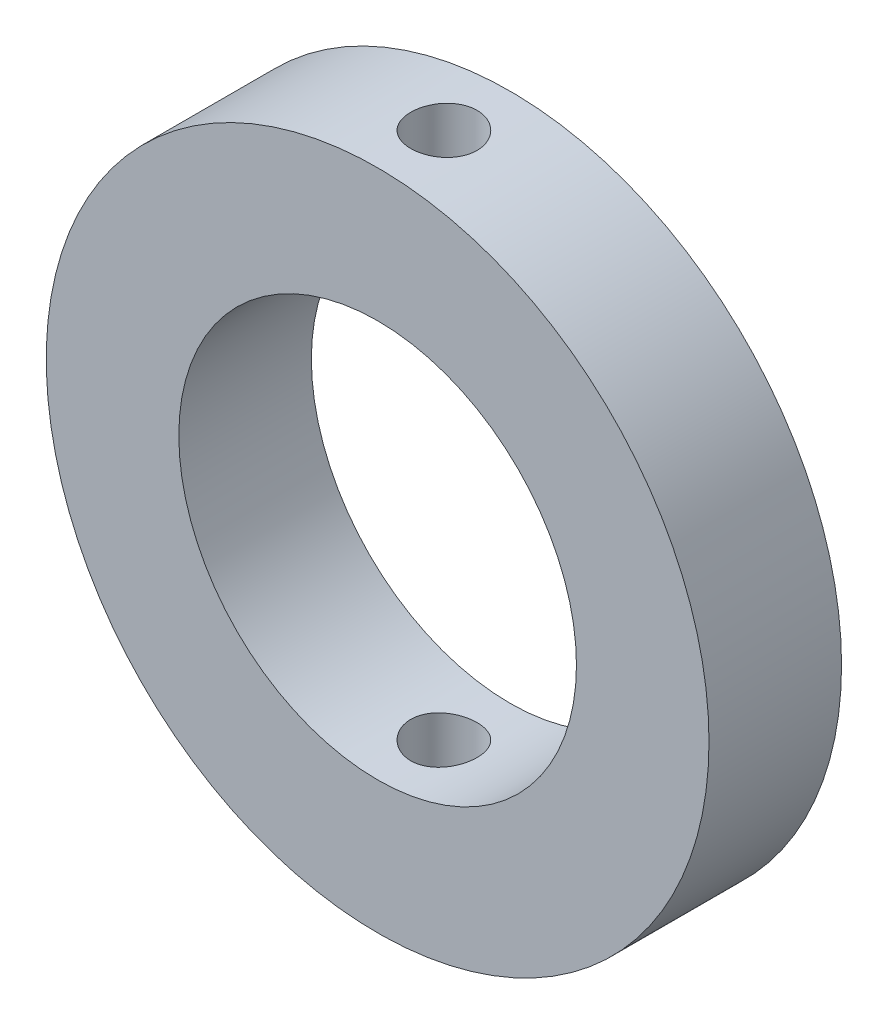
ISO-10303-21;
HEADER;
FILE_DESCRIPTION(('STEP AP214'),'2;1');
FILE_NAME('part.step','',(''),(''),'','','');
FILE_SCHEMA(('AUTOMOTIVE_DESIGN { 1 0 10303 214 1 1 1 1 }'));
ENDSEC;
DATA;
#1=APPLICATION_CONTEXT('core data for automotive mechanical design processes');
#2=APPLICATION_PROTOCOL_DEFINITION('international standard','automotive_design',2000,#1);
#3=PRODUCT_CONTEXT('',#1,'mechanical');
#4=PRODUCT('Part','Part','',(#3));
#5=PRODUCT_RELATED_PRODUCT_CATEGORY('part','',(#4));
#6=PRODUCT_DEFINITION_FORMATION('','',#4);
#7=PRODUCT_DEFINITION_CONTEXT('part definition',#1,'design');
#8=PRODUCT_DEFINITION('design','',#6,#7);
#9=PRODUCT_DEFINITION_SHAPE('','',#8);
#10=(LENGTH_UNIT() NAMED_UNIT(*) SI_UNIT(.MILLI.,.METRE.));
#11=(NAMED_UNIT(*) PLANE_ANGLE_UNIT() SI_UNIT($,.RADIAN.));
#12=(NAMED_UNIT(*) SI_UNIT($,.STERADIAN.) SOLID_ANGLE_UNIT());
#13=UNCERTAINTY_MEASURE_WITH_UNIT(LENGTH_MEASURE(1.E-05),#10,'distance_accuracy_value','');
#14=(GEOMETRIC_REPRESENTATION_CONTEXT(3) GLOBAL_UNCERTAINTY_ASSIGNED_CONTEXT((#13)) GLOBAL_UNIT_ASSIGNED_CONTEXT((#10,
#11,#12)) REPRESENTATION_CONTEXT('',''));
#15=CARTESIAN_POINT('',(0.,0.,0.));
#16=DIRECTION('',(0.,0.,1.));
#17=DIRECTION('',(1.,0.,0.));
#18=AXIS2_PLACEMENT_3D('',#15,#16,#17);
#19=CARTESIAN_POINT('',(0.,0.,10.));
#20=DIRECTION('',(0.,0.,1.));
#21=DIRECTION('',(1.,0.,0.));
#22=AXIS2_PLACEMENT_3D('',#19,#20,#21);
#23=PLANE('',#22);
#24=CARTESIAN_POINT('',(0.,0.,10.));
#25=DIRECTION('',(0.,0.,1.));
#26=DIRECTION('',(1.,0.,0.));
#27=AXIS2_PLACEMENT_3D('',#24,#25,#26);
#28=CIRCLE('',#27,25.);
#29=CARTESIAN_POINT('',(25.,0.,10.));
#30=VERTEX_POINT('',#29);
#31=EDGE_CURVE('E10',#30,#30,#28,.T.);
#32=ORIENTED_EDGE('',*,*,#31,.T.);
#33=EDGE_LOOP('',(#32));
#34=FACE_BOUND('',#33,.T.);
#35=CARTESIAN_POINT('',(0.,0.,10.));
#36=DIRECTION('',(0.,0.,1.));
#37=DIRECTION('',(1.,0.,0.));
#38=AXIS2_PLACEMENT_3D('',#35,#36,#37);
#39=CIRCLE('',#38,15.);
#40=CARTESIAN_POINT('',(15.,0.,10.));
#41=VERTEX_POINT('',#40);
#42=EDGE_CURVE('E58',#41,#41,#39,.T.);
#43=ORIENTED_EDGE('',*,*,#42,.F.);
#44=EDGE_LOOP('',(#43));
#45=FACE_BOUND('',#44,.T.);
#46=ADVANCED_FACE('F37',(#34,#45),#23,.T.);
#47=CARTESIAN_POINT('',(0.,0.,0.));
#48=DIRECTION('',(0.,0.,1.));
#49=DIRECTION('',(1.,0.,0.));
#50=AXIS2_PLACEMENT_3D('',#47,#48,#49);
#51=PLANE('',#50);
#52=CARTESIAN_POINT('',(0.,0.,0.));
#53=DIRECTION('',(0.,0.,1.));
#54=DIRECTION('',(1.,0.,0.));
#55=AXIS2_PLACEMENT_3D('',#52,#53,#54);
#56=CIRCLE('',#55,25.);
#57=CARTESIAN_POINT('',(25.,0.,0.));
#58=VERTEX_POINT('',#57);
#59=EDGE_CURVE('E52',#58,#58,#56,.T.);
#60=ORIENTED_EDGE('',*,*,#59,.F.);
#61=EDGE_LOOP('',(#60));
#62=FACE_BOUND('',#61,.T.);
#63=CARTESIAN_POINT('',(0.,0.,0.));
#64=DIRECTION('',(0.,0.,1.));
#65=DIRECTION('',(1.,0.,0.));
#66=AXIS2_PLACEMENT_3D('',#63,#64,#65);
#67=CIRCLE('',#66,15.);
#68=CARTESIAN_POINT('',(15.,0.,0.));
#69=VERTEX_POINT('',#68);
#70=EDGE_CURVE('E61',#69,#69,#67,.T.);
#71=ORIENTED_EDGE('',*,*,#70,.T.);
#72=EDGE_LOOP('',(#71));
#73=FACE_BOUND('',#72,.T.);
#74=ADVANCED_FACE('F102',(#62,#73),#51,.F.);
#75=CARTESIAN_POINT('',(0.,0.,10.));
#76=DIRECTION('',(0.,0.,-1.));
#77=DIRECTION('',(-1.,0.,0.));
#78=AXIS2_PLACEMENT_3D('',#75,#76,#77);
#79=CYLINDRICAL_SURFACE('',#78,25.);
#80=CARTESIAN_POINT('',(0.,-25.,7.5));
#81=CARTESIAN_POINT('',(0.140050884478893,-24.9999983880192,7.49999393524905));
#82=CARTESIAN_POINT('',(0.280194362919433,-24.9988106399051,7.48819182775889));
#83=CARTESIAN_POINT('',(0.556595996242093,-24.9941866898684,7.44128907427393));
#84=CARTESIAN_POINT('',(0.69284969792207,-24.9907480108506,7.40616275993853));
#85=CARTESIAN_POINT('',(0.957429188633537,-24.9820103640768,7.31364439850542));
#86=CARTESIAN_POINT('',(1.08575971153727,-24.9767125200177,7.25626579870382));
#87=CARTESIAN_POINT('',(1.33094040240102,-24.9648489348577,7.12089773017089));
#88=CARTESIAN_POINT('',(1.44779284694769,-24.9582834459533,7.04291235999965));
#89=CARTESIAN_POINT('',(1.66714887668521,-24.9445936085331,6.86824325584432));
#90=CARTESIAN_POINT('',(1.76960536208723,-24.9374675393466,6.77150050149492));
#91=CARTESIAN_POINT('',(1.95685630357746,-24.9234739226566,6.56218866434242));
#92=CARTESIAN_POINT('',(2.04164994270663,-24.9166063871229,6.44961884989403));
#93=CARTESIAN_POINT('',(2.19133492610904,-24.9038897888196,6.21155367079095));
#94=CARTESIAN_POINT('',(2.2561836636372,-24.8980429177726,6.08603138976285));
#95=CARTESIAN_POINT('',(2.3638659618569,-24.8880509386631,5.82581103523755));
#96=CARTESIAN_POINT('',(2.40670006647823,-24.8839057885556,5.69111318854013));
#97=CARTESIAN_POINT('',(2.46899760400473,-24.8778021018244,5.41684549783498));
#98=CARTESIAN_POINT('',(2.48853913250949,-24.8758362599524,5.27729355786948));
#99=CARTESIAN_POINT('',(2.5039382128384,-24.8742910765131,4.99687784151055));
#100=CARTESIAN_POINT('',(2.499796387177,-24.8747116722186,4.85601409969485));
#101=CARTESIAN_POINT('',(2.4680107006317,-24.8778851724734,4.5775117257667));
#102=CARTESIAN_POINT('',(2.44045211031138,-24.8806296147663,4.43986325167826));
#103=CARTESIAN_POINT('',(2.36274786037647,-24.8881283571855,4.17115509199726));
#104=CARTESIAN_POINT('',(2.31260189563937,-24.8928826844623,4.04009549543742));
#105=CARTESIAN_POINT('',(2.19105223470377,-24.9038752363018,3.78801603175278));
#106=CARTESIAN_POINT('',(2.11961070679995,-24.9101160977039,3.66701452627671));
#107=CARTESIAN_POINT('',(1.95752506838307,-24.923376293322,3.43868696272029));
#108=CARTESIAN_POINT('',(1.86688039584126,-24.9303956503196,3.33136130504559));
#109=CARTESIAN_POINT('',(1.66848528103017,-24.9444596328247,3.13293651502743));
#110=CARTESIAN_POINT('',(1.56066119712841,-24.9515042333249,3.04191099529799));
#111=CARTESIAN_POINT('',(1.33122370434278,-24.964795726963,2.87924091772403));
#112=CARTESIAN_POINT('',(1.209610279999,-24.9710426192064,2.80759638160881));
#113=CARTESIAN_POINT('',(0.955995264230911,-24.9820368916774,2.68572494922437));
#114=CARTESIAN_POINT('',(0.823991865974758,-24.9867840103692,2.63550178795484));
#115=CARTESIAN_POINT('',(0.55336804332483,-24.9942411860352,2.55795270822062));
#116=CARTESIAN_POINT('',(0.4147478169415,-24.9969513039266,2.53062610502344));
#117=CARTESIAN_POINT('',(0.135462747729759,-25.0000212917078,2.49973923066309));
#118=CARTESIAN_POINT('',(-0.00519075526373038,-25.0003912066934,2.49607737936875));
#119=CARTESIAN_POINT('',(-0.28510948328925,-24.9987660439199,2.51235715762191));
#120=CARTESIAN_POINT('',(-0.424374727051175,-24.9967709981117,2.5322984682882));
#121=CARTESIAN_POINT('',(-0.697270517086687,-24.9906465384799,2.59513423855394));
#122=CARTESIAN_POINT('',(-0.830912122430049,-24.986521547951,2.63798113619503));
#123=CARTESIAN_POINT('',(-1.08911080345945,-24.9765999715152,2.74536293509318));
#124=CARTESIAN_POINT('',(-1.21366767539279,-24.9708033481313,2.80989832259849));
#125=CARTESIAN_POINT('',(-1.45062045043036,-24.9581618832606,2.95907709665978));
#126=CARTESIAN_POINT('',(-1.56297414937229,-24.951313590086,3.04378722231454));
#127=CARTESIAN_POINT('',(-1.7719040582797,-24.937348321738,3.23081516935232));
#128=CARTESIAN_POINT('',(-1.86847987212294,-24.9302313398243,3.33313343267579));
#129=CARTESIAN_POINT('',(-2.04346527471786,-24.9165006035189,3.5529164366475));
#130=CARTESIAN_POINT('',(-2.12180819669886,-24.9098887534744,3.67043439135655));
#131=CARTESIAN_POINT('',(-2.25764564685957,-24.8979458115222,3.91701840036671));
#132=CARTESIAN_POINT('',(-2.31514046013471,-24.8926147021009,4.04608429672099));
#133=CARTESIAN_POINT('',(-2.40753802171119,-24.8838486908512,4.31187184866449));
#134=CARTESIAN_POINT('',(-2.44248043702965,-24.8804104612447,4.4485796002278));
#135=CARTESIAN_POINT('',(-2.48891001782366,-24.8758091320719,4.72595799490193));
#136=CARTESIAN_POINT('',(-2.50039785599879,-24.8746459672547,4.86662852423918));
#137=CARTESIAN_POINT('',(-2.49958284617814,-24.8747278276891,5.14727672089176));
#138=CARTESIAN_POINT('',(-2.48738472398278,-24.8759622521752,5.28725470720704));
#139=CARTESIAN_POINT('',(-2.43976363240913,-24.8806775972386,5.56316229292072));
#140=CARTESIAN_POINT('',(-2.4043406369054,-24.884158520343,5.69909188776495));
#141=CARTESIAN_POINT('',(-2.31130421574376,-24.8929717065797,5.96304337261964));
#142=CARTESIAN_POINT('',(-2.25369386085229,-24.898303713509,6.09106635407431));
#143=CARTESIAN_POINT('',(-2.11792888727761,-24.910218795984,6.33564222917759));
#144=CARTESIAN_POINT('',(-2.03977438363854,-24.9168018645238,6.45219518705157));
#145=CARTESIAN_POINT('',(-1.86474639071333,-24.9305121802424,6.67105918617984));
#146=CARTESIAN_POINT('',(-1.76779487222567,-24.9376416181688,6.77330769091772));
#147=CARTESIAN_POINT('',(-1.55807924806278,-24.9516213682196,6.96013058174914));
#148=CARTESIAN_POINT('',(-1.44531136027064,-24.9584716130744,7.04470072839293));
#149=CARTESIAN_POINT('',(-1.20685358540322,-24.971139051729,7.19393363463655));
#150=CARTESIAN_POINT('',(-1.08113187336691,-24.9769536006703,7.25854572736296));
#151=CARTESIAN_POINT('',(-0.820645697751379,-24.9868657312474,7.36565605705967));
#152=CARTESIAN_POINT('',(-0.685891624564025,-24.9909652477413,7.40817922738387));
#153=CARTESIAN_POINT('',(-0.458645653514262,-24.9959553443433,7.459301542712));
#154=CARTESIAN_POINT('',(-0.367606382111273,-24.9974650172958,7.47454261074839));
#155=CARTESIAN_POINT('',(-0.184391452043282,-24.9994878737697,7.49489381515441));
#156=CARTESIAN_POINT('',(-0.0922157980663945,-25.0000010614006,7.50000399330466));
#157=CARTESIAN_POINT('',(0.,-25.,7.5));
#158=B_SPLINE_CURVE_WITH_KNOTS('',3,(#80,#81,#82,#83,#84,#85,#86,#87,#88,#89,#90,#91,#92,#93,
#94,#95,#96,#97,#98,#99,#100,#101,#102,#103,#104,#105,#106,#107,#108,#109,#110,#111,#112,#113,
#114,#115,#116,#117,#118,#119,#120,#121,#122,#123,#124,#125,#126,#127,#128,#129,#130,#131,#132,
#133,#134,#135,#136,#137,#138,#139,#140,#141,#142,#143,#144,#145,#146,#147,#148,#149,#150,#151,
#152,#153,#154,#155,#156,#157),.UNSPECIFIED.,.T.,.F.,(4,2,2,2,2,2,2,2,2,2,2,2,2,2,2,2,2,2,2,2,2,
2,2,2,2,2,2,2,2,2,2,2,2,2,2,2,2,2,4),(0.,0.419815915671184,0.840094607088716,1.26011971433051,
1.68006134395696,2.10134642155736,2.52265098051765,2.94484938680555,3.3670373610626,
3.78780580112991,4.20856318139441,4.62779493602776,5.04703235404084,5.46701903432237,
5.88701800827813,6.30886835490517,6.7307191744943,7.15264351733954,7.57455524188599,
7.99465471519394,8.41474851297859,8.83397338235762,9.25320765123668,9.67384851871746,
10.0944999452558,10.516666090215,10.9388264618844,11.3602422648251,11.7816459809896,
12.2011907323489,12.620735955651,13.04022313407,13.459707963474,13.8809729356913,
14.3023388159239,14.7247657756561,15.1467148698824,15.4231416808087,15.6995673517257),.UNSPECIFIED.);
#159=CARTESIAN_POINT('',(0.,-25.,7.5));
#160=VERTEX_POINT('',#159);
#161=EDGE_CURVE('E88',#160,#160,#158,.T.);
#162=ORIENTED_EDGE('',*,*,#161,.T.);
#163=EDGE_LOOP('',(#162));
#164=FACE_BOUND('',#163,.T.);
#165=CARTESIAN_POINT('',(0.,25.,7.5));
#166=CARTESIAN_POINT('',(-0.140050884478893,24.9999983880192,7.49999393524905));
#167=CARTESIAN_POINT('',(-0.280194362919433,24.9988106399051,7.48819182775889));
#168=CARTESIAN_POINT('',(-0.556595996242093,24.9941866898684,7.44128907427393));
#169=CARTESIAN_POINT('',(-0.69284969792207,24.9907480108506,7.40616275993853));
#170=CARTESIAN_POINT('',(-0.957429188633537,24.9820103640768,7.31364439850542));
#171=CARTESIAN_POINT('',(-1.08575971153727,24.9767125200177,7.25626579870382));
#172=CARTESIAN_POINT('',(-1.33094040240102,24.9648489348577,7.12089773017089));
#173=CARTESIAN_POINT('',(-1.44779284694769,24.9582834459533,7.04291235999965));
#174=CARTESIAN_POINT('',(-1.66714887668521,24.9445936085331,6.86824325584432));
#175=CARTESIAN_POINT('',(-1.76960536208723,24.9374675393466,6.77150050149492));
#176=CARTESIAN_POINT('',(-1.95685630357746,24.9234739226566,6.56218866434242));
#177=CARTESIAN_POINT('',(-2.04164994270663,24.9166063871229,6.44961884989403));
#178=CARTESIAN_POINT('',(-2.19133492610904,24.9038897888196,6.21155367079095));
#179=CARTESIAN_POINT('',(-2.2561836636372,24.8980429177726,6.08603138976285));
#180=CARTESIAN_POINT('',(-2.3638659618569,24.8880509386631,5.82581103523755));
#181=CARTESIAN_POINT('',(-2.40670006647823,24.8839057885556,5.69111318854013));
#182=CARTESIAN_POINT('',(-2.46899760400473,24.8778021018244,5.41684549783498));
#183=CARTESIAN_POINT('',(-2.48853913250949,24.8758362599524,5.27729355786948));
#184=CARTESIAN_POINT('',(-2.5039382128384,24.8742910765131,4.99687784151055));
#185=CARTESIAN_POINT('',(-2.499796387177,24.8747116722186,4.85601409969485));
#186=CARTESIAN_POINT('',(-2.4680107006317,24.8778851724734,4.5775117257667));
#187=CARTESIAN_POINT('',(-2.44045211031138,24.8806296147663,4.43986325167826));
#188=CARTESIAN_POINT('',(-2.36274786037647,24.8881283571855,4.17115509199726));
#189=CARTESIAN_POINT('',(-2.31260189563937,24.8928826844623,4.04009549543742));
#190=CARTESIAN_POINT('',(-2.19105223470377,24.9038752363018,3.78801603175278));
#191=CARTESIAN_POINT('',(-2.11961070679995,24.9101160977039,3.66701452627671));
#192=CARTESIAN_POINT('',(-1.95752506838307,24.923376293322,3.43868696272029));
#193=CARTESIAN_POINT('',(-1.86688039584126,24.9303956503196,3.33136130504559));
#194=CARTESIAN_POINT('',(-1.66848528103017,24.9444596328247,3.13293651502743));
#195=CARTESIAN_POINT('',(-1.56066119712841,24.9515042333249,3.04191099529799));
#196=CARTESIAN_POINT('',(-1.33122370434278,24.964795726963,2.87924091772403));
#197=CARTESIAN_POINT('',(-1.209610279999,24.9710426192064,2.80759638160881));
#198=CARTESIAN_POINT('',(-0.955995264230911,24.9820368916774,2.68572494922437));
#199=CARTESIAN_POINT('',(-0.823991865974758,24.9867840103692,2.63550178795484));
#200=CARTESIAN_POINT('',(-0.55336804332483,24.9942411860352,2.55795270822062));
#201=CARTESIAN_POINT('',(-0.4147478169415,24.9969513039266,2.53062610502344));
#202=CARTESIAN_POINT('',(-0.135462747729759,25.0000212917078,2.49973923066309));
#203=CARTESIAN_POINT('',(0.00519075526373038,25.0003912066934,2.49607737936875));
#204=CARTESIAN_POINT('',(0.28510948328925,24.9987660439199,2.51235715762191));
#205=CARTESIAN_POINT('',(0.424374727051175,24.9967709981117,2.5322984682882));
#206=CARTESIAN_POINT('',(0.697270517086687,24.9906465384799,2.59513423855394));
#207=CARTESIAN_POINT('',(0.830912122430049,24.986521547951,2.63798113619503));
#208=CARTESIAN_POINT('',(1.08911080345945,24.9765999715152,2.74536293509318));
#209=CARTESIAN_POINT('',(1.21366767539279,24.9708033481313,2.80989832259849));
#210=CARTESIAN_POINT('',(1.45062045043036,24.9581618832606,2.95907709665978));
#211=CARTESIAN_POINT('',(1.56297414937229,24.951313590086,3.04378722231454));
#212=CARTESIAN_POINT('',(1.7719040582797,24.937348321738,3.23081516935232));
#213=CARTESIAN_POINT('',(1.86847987212294,24.9302313398243,3.33313343267579));
#214=CARTESIAN_POINT('',(2.04346527471786,24.9165006035189,3.5529164366475));
#215=CARTESIAN_POINT('',(2.12180819669886,24.9098887534744,3.67043439135655));
#216=CARTESIAN_POINT('',(2.25764564685957,24.8979458115222,3.91701840036671));
#217=CARTESIAN_POINT('',(2.31514046013471,24.8926147021009,4.04608429672099));
#218=CARTESIAN_POINT('',(2.40753802171119,24.8838486908512,4.31187184866449));
#219=CARTESIAN_POINT('',(2.44248043702965,24.8804104612447,4.4485796002278));
#220=CARTESIAN_POINT('',(2.48891001782366,24.8758091320719,4.72595799490193));
#221=CARTESIAN_POINT('',(2.50039785599879,24.8746459672547,4.86662852423918));
#222=CARTESIAN_POINT('',(2.49958284617814,24.8747278276891,5.14727672089176));
#223=CARTESIAN_POINT('',(2.48738472398278,24.8759622521752,5.28725470720704));
#224=CARTESIAN_POINT('',(2.43976363240913,24.8806775972386,5.56316229292072));
#225=CARTESIAN_POINT('',(2.4043406369054,24.884158520343,5.69909188776495));
#226=CARTESIAN_POINT('',(2.31130421574376,24.8929717065797,5.96304337261964));
#227=CARTESIAN_POINT('',(2.25369386085229,24.898303713509,6.09106635407431));
#228=CARTESIAN_POINT('',(2.11792888727761,24.910218795984,6.33564222917759));
#229=CARTESIAN_POINT('',(2.03977438363854,24.9168018645238,6.45219518705157));
#230=CARTESIAN_POINT('',(1.86474639071333,24.9305121802424,6.67105918617984));
#231=CARTESIAN_POINT('',(1.76779487222567,24.9376416181688,6.77330769091772));
#232=CARTESIAN_POINT('',(1.55807924806278,24.9516213682196,6.96013058174914));
#233=CARTESIAN_POINT('',(1.44531136027064,24.9584716130744,7.04470072839293));
#234=CARTESIAN_POINT('',(1.20685358540322,24.971139051729,7.19393363463655));
#235=CARTESIAN_POINT('',(1.08113187336691,24.9769536006703,7.25854572736296));
#236=CARTESIAN_POINT('',(0.820645697751379,24.9868657312474,7.36565605705967));
#237=CARTESIAN_POINT('',(0.685891624564025,24.9909652477413,7.40817922738387));
#238=CARTESIAN_POINT('',(0.458645653514262,24.9959553443433,7.459301542712));
#239=CARTESIAN_POINT('',(0.367606382111273,24.9974650172958,7.47454261074839));
#240=CARTESIAN_POINT('',(0.184391452043282,24.9994878737697,7.49489381515441));
#241=CARTESIAN_POINT('',(0.0922157980663945,25.0000010614006,7.50000399330466));
#242=CARTESIAN_POINT('',(0.,25.,7.5));
#243=B_SPLINE_CURVE_WITH_KNOTS('',3,(#165,#166,#167,#168,#169,#170,#171,#172,#173,#174,#175,
#176,#177,#178,#179,#180,#181,#182,#183,#184,#185,#186,#187,#188,#189,#190,#191,#192,#193,#194,
#195,#196,#197,#198,#199,#200,#201,#202,#203,#204,#205,#206,#207,#208,#209,#210,#211,#212,#213,
#214,#215,#216,#217,#218,#219,#220,#221,#222,#223,#224,#225,#226,#227,#228,#229,#230,#231,#232,
#233,#234,#235,#236,#237,#238,#239,#240,#241,#242),.UNSPECIFIED.,.T.,.F.,(4,2,2,2,2,2,2,2,2,2,2,
2,2,2,2,2,2,2,2,2,2,2,2,2,2,2,2,2,2,2,2,2,2,2,2,2,2,2,4),(0.,0.419815915671184,
0.840094607088716,1.26011971433051,1.68006134395696,2.10134642155736,2.52265098051765,
2.94484938680555,3.3670373610626,3.78780580112991,4.20856318139441,4.62779493602776,
5.04703235404084,5.46701903432237,5.88701800827813,6.30886835490517,6.7307191744943,
7.15264351733954,7.57455524188599,7.99465471519394,8.41474851297859,8.83397338235762,
9.25320765123668,9.67384851871746,10.0944999452558,10.516666090215,10.9388264618844,
11.3602422648251,11.7816459809896,12.2011907323489,12.620735955651,13.04022313407,
13.459707963474,13.8809729356913,14.3023388159239,14.7247657756561,15.1467148698824,
15.4231416808087,15.6995673517257),.UNSPECIFIED.);
#244=CARTESIAN_POINT('',(0.,25.,7.5));
#245=VERTEX_POINT('',#244);
#246=EDGE_CURVE('E82',#245,#245,#243,.T.);
#247=ORIENTED_EDGE('',*,*,#246,.T.);
#248=EDGE_LOOP('',(#247));
#249=FACE_BOUND('',#248,.T.);
#250=ORIENTED_EDGE('',*,*,#31,.F.);
#251=EDGE_LOOP('',(#250));
#252=FACE_BOUND('',#251,.T.);
#253=ORIENTED_EDGE('',*,*,#59,.T.);
#254=EDGE_LOOP('',(#253));
#255=FACE_BOUND('',#254,.T.);
#256=ADVANCED_FACE('F39',(#164,#249,#252,#255),#79,.T.);
#257=CARTESIAN_POINT('',(0.,0.,10.));
#258=DIRECTION('',(0.,0.,-1.));
#259=DIRECTION('',(-1.,0.,0.));
#260=AXIS2_PLACEMENT_3D('',#257,#258,#259);
#261=CYLINDRICAL_SURFACE('',#260,15.);
#262=CARTESIAN_POINT('',(0.,-15.,7.5));
#263=CARTESIAN_POINT('',(0.139390904958215,-14.9999976116882,7.49999441105218));
#264=CARTESIAN_POINT('',(0.278857881838821,-14.9980367791303,7.48830272503108));
#265=CARTESIAN_POINT('',(0.553880221673043,-14.9904034494139,7.44186434123468));
#266=CARTESIAN_POINT('',(0.689431867959247,-14.9847275392389,7.4070964430884));
#267=CARTESIAN_POINT('',(0.952604747212645,-14.9703006823645,7.31558455140725));
#268=CARTESIAN_POINT('',(1.0802323684319,-14.9615522515919,7.25885853435943));
#269=CARTESIAN_POINT('',(1.32414184197795,-14.9419422708207,7.1250877079476));
#270=CARTESIAN_POINT('',(1.44042498987859,-14.9310809625443,7.048045222517));
#271=CARTESIAN_POINT('',(1.65947261429168,-14.9083331745831,6.87504491617954));
#272=CARTESIAN_POINT('',(1.76211290353497,-14.8964387181486,6.77893088536387));
#273=CARTESIAN_POINT('',(1.94988849865993,-14.8730262687673,6.57085203152719));
#274=CARTESIAN_POINT('',(2.03502269939097,-14.8615082996267,6.45888620854339));
#275=CARTESIAN_POINT('',(2.18586712560513,-14.8400756575978,6.22142903380294));
#276=CARTESIAN_POINT('',(2.251454552861,-14.8301712909164,6.09585866319524));
#277=CARTESIAN_POINT('',(2.36055836541122,-14.8131978979467,5.83529043569937));
#278=CARTESIAN_POINT('',(2.40407624156561,-14.8061286801431,5.70029321632237));
#279=CARTESIAN_POINT('',(2.46741437778481,-14.7957053684276,5.42601972514346));
#280=CARTESIAN_POINT('',(2.4874490291354,-14.792317684857,5.28679426349861));
#281=CARTESIAN_POINT('',(2.50391672528988,-14.7895393893665,5.00691972311653));
#282=CARTESIAN_POINT('',(2.500351440389,-14.7901484945721,4.8662707458327));
#283=CARTESIAN_POINT('',(2.46989509839615,-14.7952642886356,4.58907213872455));
#284=CARTESIAN_POINT('',(2.44324488188977,-14.7997307331892,4.45249519645477));
#285=CARTESIAN_POINT('',(2.36775314040345,-14.8119949521101,4.18577868217087));
#286=CARTESIAN_POINT('',(2.31891085431974,-14.8197928407327,4.05563933111145));
#287=CARTESIAN_POINT('',(2.20017724609391,-14.837884793341,3.80477117655908));
#288=CARTESIAN_POINT('',(2.13018591387971,-14.8481906710733,3.68409059391877));
#289=CARTESIAN_POINT('',(1.97121201755743,-14.8701291841501,3.45609559946161));
#290=CARTESIAN_POINT('',(1.88222792065429,-14.8817619265429,3.34878226754507));
#291=CARTESIAN_POINT('',(1.68648221215905,-14.9052202787979,3.14917391419265));
#292=CARTESIAN_POINT('',(1.57951396387313,-14.9170464923165,3.05708148145992));
#293=CARTESIAN_POINT('',(1.35153524898165,-14.9394260139672,2.89212223733466));
#294=CARTESIAN_POINT('',(1.23052469190642,-14.9499793138975,2.81925554981677));
#295=CARTESIAN_POINT('',(0.977705916166711,-14.9686389289291,2.69479777286372));
#296=CARTESIAN_POINT('',(0.845888725564661,-14.9767431840745,2.64322458066874));
#297=CARTESIAN_POINT('',(0.575298345602731,-14.9895750301266,2.56300578475402));
#298=CARTESIAN_POINT('',(0.436525739179468,-14.9943029035047,2.53435826302628));
#299=CARTESIAN_POINT('',(0.157709901301623,-14.9998112984269,2.50107864153886));
#300=CARTESIAN_POINT('',(0.0177007371510106,-15.0006375301278,2.49616842819439));
#301=CARTESIAN_POINT('',(-0.261139772889888,-14.9983747442117,2.50976134442812));
#302=CARTESIAN_POINT('',(-0.39997116389204,-14.9952858772412,2.52826357313374));
#303=CARTESIAN_POINT('',(-0.671656175546764,-14.985568269382,2.58792484933548));
#304=CARTESIAN_POINT('',(-0.80454086838538,-14.9789610480131,2.62894620839012));
#305=CARTESIAN_POINT('',(-1.06154688486044,-14.9629446445536,2.73233451819953));
#306=CARTESIAN_POINT('',(-1.18566771590972,-14.9535353051202,2.79470266763527));
#307=CARTESIAN_POINT('',(-1.42283068946896,-14.9328451630241,2.93965112469679));
#308=CARTESIAN_POINT('',(-1.53576525093715,-14.9215485588702,3.02240515616725));
#309=CARTESIAN_POINT('',(-1.74624358550269,-14.898384673919,3.20553731538506));
#310=CARTESIAN_POINT('',(-1.84378623969658,-14.8865173517155,3.30591672327667));
#311=CARTESIAN_POINT('',(-2.021742779658,-14.8634017523585,3.52269754807142));
#312=CARTESIAN_POINT('',(-2.10196876111372,-14.8521611613711,3.63925416551441));
#313=CARTESIAN_POINT('',(-2.24170231029499,-14.8317152977788,3.88435296913854));
#314=CARTESIAN_POINT('',(-2.30121053476982,-14.8225099606602,4.0128947752275));
#315=CARTESIAN_POINT('',(-2.39753833147315,-14.807234536977,4.27778973281213));
#316=CARTESIAN_POINT('',(-2.43445143254795,-14.8011515431106,4.41410809503049));
#317=CARTESIAN_POINT('',(-2.48483545377828,-14.7927771683526,4.69112012922176));
#318=CARTESIAN_POINT('',(-2.49830841194617,-14.7904854578272,4.83181341973205));
#319=CARTESIAN_POINT('',(-2.50137286604735,-14.7899673308401,5.11170516596241));
#320=CARTESIAN_POINT('',(-2.49126013612519,-14.7916905650565,5.25090037857529));
#321=CARTESIAN_POINT('',(-2.44807983895685,-14.7988978145373,5.52557924805077));
#322=CARTESIAN_POINT('',(-2.41501234611248,-14.8043818176121,5.66106291694187));
#323=CARTESIAN_POINT('',(-2.3269744895949,-14.8184735628172,5.92435843729261));
#324=CARTESIAN_POINT('',(-2.27202959060044,-14.8270776721967,6.05217901005602));
#325=CARTESIAN_POINT('',(-2.14182700391591,-14.8464436892221,6.29683566919485));
#326=CARTESIAN_POINT('',(-2.06656830874856,-14.857205703884,6.41367121037213));
#327=CARTESIAN_POINT('',(-1.89681888437216,-14.8798345404562,6.63453558310775));
#328=CARTESIAN_POINT('',(-1.80211056359365,-14.891712955763,6.73839601670027));
#329=CARTESIAN_POINT('',(-1.59660903138023,-14.9151437236084,6.92885160447494));
#330=CARTESIAN_POINT('',(-1.48581211291264,-14.9266960002655,7.01544276863817));
#331=CARTESIAN_POINT('',(-1.25036916964028,-14.9482652964222,7.16944826819995));
#332=CARTESIAN_POINT('',(-1.12563278753282,-14.958271162531,7.23672603931295));
#333=CARTESIAN_POINT('',(-0.866513069378982,-14.9755116760178,7.34926948460992));
#334=CARTESIAN_POINT('',(-0.732139494830011,-14.9827490817748,7.3945570810797));
#335=CARTESIAN_POINT('',(-0.497703310045402,-14.9920579083296,7.45200527412667));
#336=CARTESIAN_POINT('',(-0.399058830298448,-14.9950202727336,7.46997446961597));
#337=CARTESIAN_POINT('',(-0.200289310319809,-14.9989921598612,7.49397373784475));
#338=CARTESIAN_POINT('',(-0.100164295608494,-15.0000017162064,7.50000401613736));
#339=CARTESIAN_POINT('',(0.,-15.,7.5));
#340=B_SPLINE_CURVE_WITH_KNOTS('',3,(#262,#263,#264,#265,#266,#267,#268,#269,#270,#271,#272,
#273,#274,#275,#276,#277,#278,#279,#280,#281,#282,#283,#284,#285,#286,#287,#288,#289,#290,#291,
#292,#293,#294,#295,#296,#297,#298,#299,#300,#301,#302,#303,#304,#305,#306,#307,#308,#309,#310,
#311,#312,#313,#314,#315,#316,#317,#318,#319,#320,#321,#322,#323,#324,#325,#326,#327,#328,#329,
#330,#331,#332,#333,#334,#335,#336,#337,#338,#339),.UNSPECIFIED.,.T.,.F.,(4,2,2,2,2,2,2,2,2,2,2,
2,2,2,2,2,2,2,2,2,2,2,2,2,2,2,2,2,2,2,2,2,2,2,2,2,2,2,4),(0.,0.41780658493851,0.835997545695421,
1.25384686702527,1.67164841267479,2.09302491062332,2.51442800169857,2.9384252082384,
3.36239376876181,3.78246077103424,4.20249804320887,4.61820521760409,5.03392665025381,
5.45164556632558,5.86939820680574,6.29232769911327,6.71525991635848,7.13854688915904,
7.56179844521149,7.98007883491397,8.3983431303586,8.81407807006416,9.22983635826067,
9.64926825627024,10.0687306305428,10.4925382200762,10.9163323737594,11.3383602234177,
11.7603513778662,12.177079095227,12.5938054618813,13.0100481822622,13.4263115502934,
13.8475138419339,14.2688133387897,14.693022316072,15.1168075213007,15.4170424816402,
15.7172722727697),.UNSPECIFIED.);
#341=CARTESIAN_POINT('',(0.,-15.,7.5));
#342=VERTEX_POINT('',#341);
#343=EDGE_CURVE('E42',#342,#342,#340,.T.);
#344=ORIENTED_EDGE('',*,*,#343,.F.);
#345=EDGE_LOOP('',(#344));
#346=FACE_BOUND('',#345,.T.);
#347=CARTESIAN_POINT('',(0.,15.,7.5));
#348=CARTESIAN_POINT('',(-0.139390904958215,14.9999976116882,7.49999441105218));
#349=CARTESIAN_POINT('',(-0.278857881838821,14.9980367791303,7.48830272503108));
#350=CARTESIAN_POINT('',(-0.553880221673043,14.9904034494139,7.44186434123468));
#351=CARTESIAN_POINT('',(-0.689431867959247,14.9847275392389,7.4070964430884));
#352=CARTESIAN_POINT('',(-0.952604747212645,14.9703006823645,7.31558455140725));
#353=CARTESIAN_POINT('',(-1.0802323684319,14.9615522515919,7.25885853435943));
#354=CARTESIAN_POINT('',(-1.32414184197795,14.9419422708207,7.1250877079476));
#355=CARTESIAN_POINT('',(-1.44042498987859,14.9310809625443,7.048045222517));
#356=CARTESIAN_POINT('',(-1.65947261429168,14.9083331745831,6.87504491617954));
#357=CARTESIAN_POINT('',(-1.76211290353497,14.8964387181486,6.77893088536387));
#358=CARTESIAN_POINT('',(-1.94988849865993,14.8730262687673,6.57085203152719));
#359=CARTESIAN_POINT('',(-2.03502269939097,14.8615082996267,6.45888620854339));
#360=CARTESIAN_POINT('',(-2.18586712560513,14.8400756575978,6.22142903380294));
#361=CARTESIAN_POINT('',(-2.251454552861,14.8301712909164,6.09585866319524));
#362=CARTESIAN_POINT('',(-2.36055836541122,14.8131978979467,5.83529043569937));
#363=CARTESIAN_POINT('',(-2.40407624156561,14.8061286801431,5.70029321632237));
#364=CARTESIAN_POINT('',(-2.46741437778481,14.7957053684276,5.42601972514346));
#365=CARTESIAN_POINT('',(-2.4874490291354,14.792317684857,5.28679426349861));
#366=CARTESIAN_POINT('',(-2.50391672528988,14.7895393893665,5.00691972311653));
#367=CARTESIAN_POINT('',(-2.500351440389,14.7901484945721,4.8662707458327));
#368=CARTESIAN_POINT('',(-2.46989509839615,14.7952642886356,4.58907213872455));
#369=CARTESIAN_POINT('',(-2.44324488188977,14.7997307331892,4.45249519645477));
#370=CARTESIAN_POINT('',(-2.36775314040345,14.8119949521101,4.18577868217087));
#371=CARTESIAN_POINT('',(-2.31891085431974,14.8197928407327,4.05563933111145));
#372=CARTESIAN_POINT('',(-2.20017724609391,14.837884793341,3.80477117655908));
#373=CARTESIAN_POINT('',(-2.13018591387971,14.8481906710733,3.68409059391877));
#374=CARTESIAN_POINT('',(-1.97121201755743,14.8701291841501,3.45609559946161));
#375=CARTESIAN_POINT('',(-1.88222792065429,14.8817619265429,3.34878226754507));
#376=CARTESIAN_POINT('',(-1.68648221215905,14.9052202787979,3.14917391419265));
#377=CARTESIAN_POINT('',(-1.57951396387313,14.9170464923165,3.05708148145992));
#378=CARTESIAN_POINT('',(-1.35153524898165,14.9394260139672,2.89212223733466));
#379=CARTESIAN_POINT('',(-1.23052469190642,14.9499793138975,2.81925554981677));
#380=CARTESIAN_POINT('',(-0.977705916166711,14.9686389289291,2.69479777286372));
#381=CARTESIAN_POINT('',(-0.845888725564661,14.9767431840745,2.64322458066874));
#382=CARTESIAN_POINT('',(-0.575298345602731,14.9895750301266,2.56300578475402));
#383=CARTESIAN_POINT('',(-0.436525739179468,14.9943029035047,2.53435826302628));
#384=CARTESIAN_POINT('',(-0.157709901301623,14.9998112984269,2.50107864153886));
#385=CARTESIAN_POINT('',(-0.0177007371510106,15.0006375301278,2.49616842819439));
#386=CARTESIAN_POINT('',(0.261139772889888,14.9983747442117,2.50976134442812));
#387=CARTESIAN_POINT('',(0.39997116389204,14.9952858772412,2.52826357313374));
#388=CARTESIAN_POINT('',(0.671656175546764,14.985568269382,2.58792484933548));
#389=CARTESIAN_POINT('',(0.80454086838538,14.9789610480131,2.62894620839012));
#390=CARTESIAN_POINT('',(1.06154688486044,14.9629446445536,2.73233451819953));
#391=CARTESIAN_POINT('',(1.18566771590972,14.9535353051202,2.79470266763527));
#392=CARTESIAN_POINT('',(1.42283068946896,14.9328451630241,2.93965112469679));
#393=CARTESIAN_POINT('',(1.53576525093715,14.9215485588702,3.02240515616725));
#394=CARTESIAN_POINT('',(1.74624358550269,14.898384673919,3.20553731538506));
#395=CARTESIAN_POINT('',(1.84378623969658,14.8865173517155,3.30591672327667));
#396=CARTESIAN_POINT('',(2.021742779658,14.8634017523585,3.52269754807142));
#397=CARTESIAN_POINT('',(2.10196876111372,14.8521611613711,3.63925416551441));
#398=CARTESIAN_POINT('',(2.24170231029499,14.8317152977788,3.88435296913854));
#399=CARTESIAN_POINT('',(2.30121053476982,14.8225099606602,4.0128947752275));
#400=CARTESIAN_POINT('',(2.39753833147315,14.807234536977,4.27778973281213));
#401=CARTESIAN_POINT('',(2.43445143254795,14.8011515431106,4.41410809503049));
#402=CARTESIAN_POINT('',(2.48483545377828,14.7927771683526,4.69112012922176));
#403=CARTESIAN_POINT('',(2.49830841194617,14.7904854578272,4.83181341973205));
#404=CARTESIAN_POINT('',(2.50137286604735,14.7899673308401,5.11170516596241));
#405=CARTESIAN_POINT('',(2.49126013612519,14.7916905650565,5.25090037857529));
#406=CARTESIAN_POINT('',(2.44807983895685,14.7988978145373,5.52557924805077));
#407=CARTESIAN_POINT('',(2.41501234611248,14.8043818176121,5.66106291694187));
#408=CARTESIAN_POINT('',(2.3269744895949,14.8184735628172,5.92435843729261));
#409=CARTESIAN_POINT('',(2.27202959060044,14.8270776721967,6.05217901005602));
#410=CARTESIAN_POINT('',(2.14182700391591,14.8464436892221,6.29683566919485));
#411=CARTESIAN_POINT('',(2.06656830874856,14.857205703884,6.41367121037213));
#412=CARTESIAN_POINT('',(1.89681888437216,14.8798345404562,6.63453558310775));
#413=CARTESIAN_POINT('',(1.80211056359365,14.891712955763,6.73839601670027));
#414=CARTESIAN_POINT('',(1.59660903138023,14.9151437236084,6.92885160447494));
#415=CARTESIAN_POINT('',(1.48581211291264,14.9266960002655,7.01544276863817));
#416=CARTESIAN_POINT('',(1.25036916964028,14.9482652964222,7.16944826819995));
#417=CARTESIAN_POINT('',(1.12563278753282,14.958271162531,7.23672603931295));
#418=CARTESIAN_POINT('',(0.866513069378982,14.9755116760178,7.34926948460992));
#419=CARTESIAN_POINT('',(0.732139494830011,14.9827490817748,7.3945570810797));
#420=CARTESIAN_POINT('',(0.497703310045402,14.9920579083296,7.45200527412667));
#421=CARTESIAN_POINT('',(0.399058830298448,14.9950202727336,7.46997446961597));
#422=CARTESIAN_POINT('',(0.200289310319809,14.9989921598612,7.49397373784475));
#423=CARTESIAN_POINT('',(0.100164295608494,15.0000017162064,7.50000401613736));
#424=CARTESIAN_POINT('',(0.,15.,7.5));
#425=B_SPLINE_CURVE_WITH_KNOTS('',3,(#347,#348,#349,#350,#351,#352,#353,#354,#355,#356,#357,
#358,#359,#360,#361,#362,#363,#364,#365,#366,#367,#368,#369,#370,#371,#372,#373,#374,#375,#376,
#377,#378,#379,#380,#381,#382,#383,#384,#385,#386,#387,#388,#389,#390,#391,#392,#393,#394,#395,
#396,#397,#398,#399,#400,#401,#402,#403,#404,#405,#406,#407,#408,#409,#410,#411,#412,#413,#414,
#415,#416,#417,#418,#419,#420,#421,#422,#423,#424),.UNSPECIFIED.,.T.,.F.,(4,2,2,2,2,2,2,2,2,2,2,
2,2,2,2,2,2,2,2,2,2,2,2,2,2,2,2,2,2,2,2,2,2,2,2,2,2,2,4),(0.,0.41780658493851,0.835997545695421,
1.25384686702527,1.67164841267479,2.09302491062332,2.51442800169857,2.9384252082384,
3.36239376876181,3.78246077103424,4.20249804320887,4.61820521760409,5.03392665025381,
5.45164556632558,5.86939820680574,6.29232769911327,6.71525991635848,7.13854688915904,
7.56179844521149,7.98007883491397,8.3983431303586,8.81407807006416,9.22983635826067,
9.64926825627024,10.0687306305428,10.4925382200762,10.9163323737594,11.3383602234177,
11.7603513778662,12.177079095227,12.5938054618813,13.0100481822622,13.4263115502934,
13.8475138419339,14.2688133387897,14.693022316072,15.1168075213007,15.4170424816402,
15.7172722727697),.UNSPECIFIED.);
#426=CARTESIAN_POINT('',(0.,15.,7.5));
#427=VERTEX_POINT('',#426);
#428=EDGE_CURVE('E63',#427,#427,#425,.T.);
#429=ORIENTED_EDGE('',*,*,#428,.F.);
#430=EDGE_LOOP('',(#429));
#431=FACE_BOUND('',#430,.T.);
#432=ORIENTED_EDGE('',*,*,#42,.T.);
#433=EDGE_LOOP('',(#432));
#434=FACE_BOUND('',#433,.T.);
#435=ORIENTED_EDGE('',*,*,#70,.F.);
#436=EDGE_LOOP('',(#435));
#437=FACE_BOUND('',#436,.T.);
#438=ADVANCED_FACE('F69',(#346,#431,#434,#437),#261,.F.);
#439=CARTESIAN_POINT('',(0.,-37.5,5.));
#440=DIRECTION('',(0.,1.,0.));
#441=DIRECTION('',(0.,0.,1.));
#442=AXIS2_PLACEMENT_3D('',#439,#440,#441);
#443=CYLINDRICAL_SURFACE('',#442,2.5);
#444=ORIENTED_EDGE('',*,*,#428,.T.);
#445=EDGE_LOOP('',(#444));
#446=FACE_BOUND('',#445,.T.);
#447=ORIENTED_EDGE('',*,*,#246,.F.);
#448=EDGE_LOOP('',(#447));
#449=FACE_BOUND('',#448,.T.);
#450=ADVANCED_FACE('F75',(#446,#449),#443,.F.);
#451=ORIENTED_EDGE('',*,*,#343,.T.);
#452=EDGE_LOOP('',(#451));
#453=FACE_BOUND('',#452,.T.);
#454=ORIENTED_EDGE('',*,*,#161,.F.);
#455=EDGE_LOOP('',(#454));
#456=FACE_BOUND('',#455,.T.);
#457=ADVANCED_FACE('F72',(#453,#456),#443,.F.);
#458=CLOSED_SHELL('',(#46,#74,#256,#438,#450,#457));
#459=MANIFOLD_SOLID_BREP('B2',#458);
#460=ADVANCED_BREP_SHAPE_REPRESENTATION('',(#18,#459),#14);
#461=SHAPE_DEFINITION_REPRESENTATION(#9,#460);
ENDSEC;
END-ISO-10303-21;
